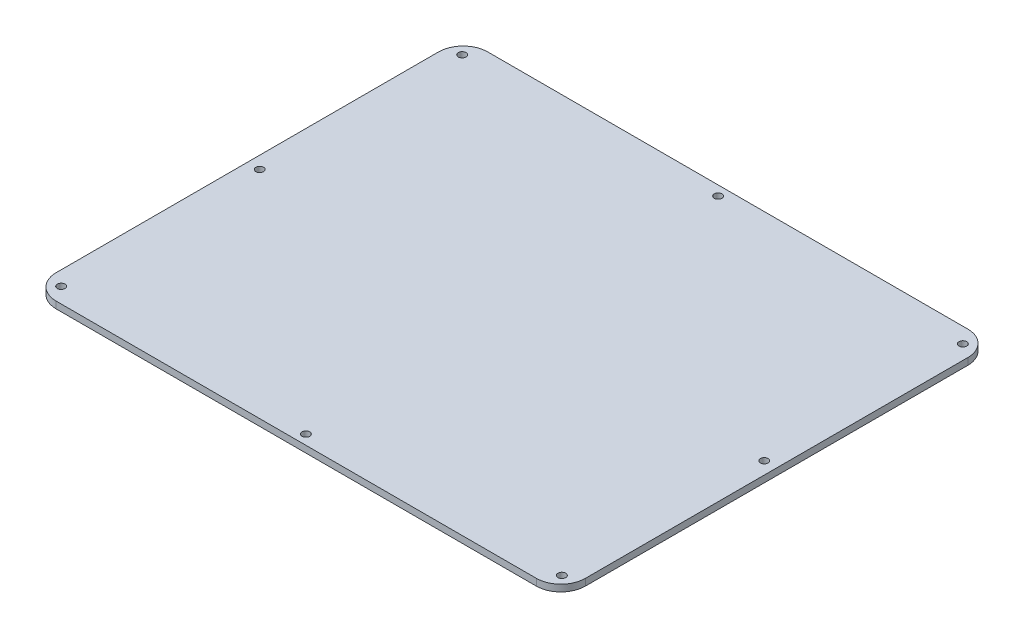
ISO-10303-21;
HEADER;
FILE_DESCRIPTION(('STEP AP214'),'2;1');
FILE_NAME('part.step','',(''),(''),'','','');
FILE_SCHEMA(('AUTOMOTIVE_DESIGN { 1 0 10303 214 1 1 1 1 }'));
ENDSEC;
DATA;
#1=APPLICATION_CONTEXT('core data for automotive mechanical design processes');
#2=APPLICATION_PROTOCOL_DEFINITION('international standard','automotive_design',2000,#1);
#3=PRODUCT_CONTEXT('',#1,'mechanical');
#4=PRODUCT('Part','Part','',(#3));
#5=PRODUCT_RELATED_PRODUCT_CATEGORY('part','',(#4));
#6=PRODUCT_DEFINITION_FORMATION('','',#4);
#7=PRODUCT_DEFINITION_CONTEXT('part definition',#1,'design');
#8=PRODUCT_DEFINITION('design','',#6,#7);
#9=PRODUCT_DEFINITION_SHAPE('','',#8);
#10=(LENGTH_UNIT() NAMED_UNIT(*) SI_UNIT(.MILLI.,.METRE.));
#11=(NAMED_UNIT(*) PLANE_ANGLE_UNIT() SI_UNIT($,.RADIAN.));
#12=(NAMED_UNIT(*) SI_UNIT($,.STERADIAN.) SOLID_ANGLE_UNIT());
#13=UNCERTAINTY_MEASURE_WITH_UNIT(LENGTH_MEASURE(1.E-05),#10,'distance_accuracy_value','');
#14=(GEOMETRIC_REPRESENTATION_CONTEXT(3) GLOBAL_UNCERTAINTY_ASSIGNED_CONTEXT((#13)) GLOBAL_UNIT_ASSIGNED_CONTEXT((#10,
#11,#12)) REPRESENTATION_CONTEXT('',''));
#15=CARTESIAN_POINT('',(0.,0.,0.));
#16=DIRECTION('',(0.,0.,1.));
#17=DIRECTION('',(1.,0.,0.));
#18=AXIS2_PLACEMENT_3D('',#15,#16,#17);
#19=CARTESIAN_POINT('',(0.,3.5,0.));
#20=DIRECTION('',(0.,1.,0.));
#21=DIRECTION('',(0.,0.,1.));
#22=AXIS2_PLACEMENT_3D('',#19,#20,#21);
#23=PLANE('',#22);
#24=CARTESIAN_POINT('',(-19.2686528028536,3.5,118.954205425769));
#25=DIRECTION('',(0.,-1.,0.));
#26=DIRECTION('',(0.,0.,-1.));
#27=AXIS2_PLACEMENT_3D('',#24,#25,#26);
#28=CIRCLE('',#27,2.);
#29=CARTESIAN_POINT('',(-19.2686528028536,3.5,116.954205425769));
#30=VERTEX_POINT('',#29);
#31=EDGE_CURVE('E204',#30,#30,#28,.T.);
#32=ORIENTED_EDGE('',*,*,#31,.T.);
#33=EDGE_LOOP('',(#32));
#34=FACE_BOUND('',#33,.T.);
#35=CARTESIAN_POINT('',(-149.618652802854,3.5,12.4542054257695));
#36=DIRECTION('',(0.,-1.,0.));
#37=DIRECTION('',(0.,0.,-1.));
#38=AXIS2_PLACEMENT_3D('',#35,#36,#37);
#39=CIRCLE('',#38,2.00000000000005);
#40=CARTESIAN_POINT('',(-149.618652802854,3.5,10.4542054257694));
#41=VERTEX_POINT('',#40);
#42=EDGE_CURVE('E180',#41,#41,#39,.T.);
#43=ORIENTED_EDGE('',*,*,#42,.T.);
#44=EDGE_LOOP('',(#43));
#45=FACE_BOUND('',#44,.T.);
#46=CARTESIAN_POINT('',(-148.618652802854,3.5,116.054205425769));
#47=DIRECTION('',(0.,1.,0.));
#48=DIRECTION('',(0.,0.,1.));
#49=AXIS2_PLACEMENT_3D('',#46,#47,#48);
#50=CIRCLE('',#49,2.);
#51=CARTESIAN_POINT('',(-148.618652802854,3.5,118.054205425769));
#52=VERTEX_POINT('',#51);
#53=EDGE_CURVE('E177',#52,#52,#50,.T.);
#54=ORIENTED_EDGE('',*,*,#53,.F.);
#55=EDGE_LOOP('',(#54));
#56=FACE_BOUND('',#55,.T.);
#57=DIRECTION('',(0.,0.,1.));
#58=VECTOR('',#57,1.);
#59=CARTESIAN_POINT('',(-156.018652802854,3.5,-99.0457945742306));
#60=LINE('',#59,#58);
#61=CARTESIAN_POINT('',(-156.018652802854,3.5,-86.3457945742306));
#62=VERTEX_POINT('',#61);
#63=CARTESIAN_POINT('',(-156.018652802854,3.5,111.254205425769));
#64=VERTEX_POINT('',#63);
#65=EDGE_CURVE('E137',#62,#64,#60,.T.);
#66=ORIENTED_EDGE('',*,*,#65,.T.);
#67=CARTESIAN_POINT('',(-143.318652802854,3.5,111.254205425769));
#68=DIRECTION('',(0.,1.,0.));
#69=DIRECTION('',(0.,0.,1.));
#70=AXIS2_PLACEMENT_3D('',#67,#68,#69);
#71=CIRCLE('',#70,12.7);
#72=CARTESIAN_POINT('',(-143.318652802854,3.5,123.954205425769));
#73=VERTEX_POINT('',#72);
#74=EDGE_CURVE('E152',#64,#73,#71,.T.);
#75=ORIENTED_EDGE('',*,*,#74,.T.);
#76=DIRECTION('',(1.,0.,0.));
#77=VECTOR('',#76,1.);
#78=CARTESIAN_POINT('',(-156.018652802854,3.5,123.954205425769));
#79=LINE('',#78,#77);
#80=CARTESIAN_POINT('',(104.781347197146,3.5,123.954205425769));
#81=VERTEX_POINT('',#80);
#82=EDGE_CURVE('E119',#73,#81,#79,.T.);
#83=ORIENTED_EDGE('',*,*,#82,.T.);
#84=CARTESIAN_POINT('',(104.781347197146,3.5,111.254205425769));
#85=DIRECTION('',(0.,1.,0.));
#86=DIRECTION('',(0.,0.,1.));
#87=AXIS2_PLACEMENT_3D('',#84,#85,#86);
#88=CIRCLE('',#87,12.7);
#89=CARTESIAN_POINT('',(117.481347197146,3.5,111.254205425769));
#90=VERTEX_POINT('',#89);
#91=EDGE_CURVE('E147',#81,#90,#88,.T.);
#92=ORIENTED_EDGE('',*,*,#91,.T.);
#93=DIRECTION('',(0.,0.,-1.));
#94=VECTOR('',#93,1.);
#95=CARTESIAN_POINT('',(117.481347197146,3.5,-99.0457945742306));
#96=LINE('',#95,#94);
#97=CARTESIAN_POINT('',(117.481347197146,3.5,-86.3457945742306));
#98=VERTEX_POINT('',#97);
#99=EDGE_CURVE('E163',#90,#98,#96,.T.);
#100=ORIENTED_EDGE('',*,*,#99,.T.);
#101=CARTESIAN_POINT('',(104.781347197146,3.5,-86.3457945742306));
#102=DIRECTION('',(0.,1.,0.));
#103=DIRECTION('',(0.,0.,1.));
#104=AXIS2_PLACEMENT_3D('',#101,#102,#103);
#105=CIRCLE('',#104,12.7);
#106=CARTESIAN_POINT('',(104.781347197146,3.5,-99.0457945742306));
#107=VERTEX_POINT('',#106);
#108=EDGE_CURVE('E55',#98,#107,#105,.T.);
#109=ORIENTED_EDGE('',*,*,#108,.T.);
#110=DIRECTION('',(-1.,0.,0.));
#111=VECTOR('',#110,1.);
#112=CARTESIAN_POINT('',(-156.018652802854,3.5,-99.0457945742306));
#113=LINE('',#112,#111);
#114=CARTESIAN_POINT('',(-143.318652802854,3.5,-99.0457945742306));
#115=VERTEX_POINT('',#114);
#116=EDGE_CURVE('E138',#107,#115,#113,.T.);
#117=ORIENTED_EDGE('',*,*,#116,.T.);
#118=CARTESIAN_POINT('',(-143.318652802854,3.5,-86.3457945742306));
#119=DIRECTION('',(0.,1.,0.));
#120=DIRECTION('',(0.,0.,1.));
#121=AXIS2_PLACEMENT_3D('',#118,#119,#120);
#122=CIRCLE('',#121,12.7);
#123=EDGE_CURVE('E150',#115,#62,#122,.T.);
#124=ORIENTED_EDGE('',*,*,#123,.T.);
#125=EDGE_LOOP('',(#66,#75,#83,#92,#100,#109,#117,#124));
#126=FACE_BOUND('',#125,.T.);
#127=CARTESIAN_POINT('',(-148.618652802854,3.5,-91.1457945742306));
#128=DIRECTION('',(0.,1.,0.));
#129=DIRECTION('',(0.,0.,1.));
#130=AXIS2_PLACEMENT_3D('',#127,#128,#129);
#131=CIRCLE('',#130,2.);
#132=CARTESIAN_POINT('',(-148.618652802854,3.5,-89.1457945742306));
#133=VERTEX_POINT('',#132);
#134=EDGE_CURVE('E193',#133,#133,#131,.T.);
#135=ORIENTED_EDGE('',*,*,#134,.F.);
#136=EDGE_LOOP('',(#135));
#137=FACE_BOUND('',#136,.T.);
#138=CARTESIAN_POINT('',(-19.2686528028536,3.5,-94.0457945742306));
#139=DIRECTION('',(0.,1.,0.));
#140=DIRECTION('',(0.,0.,1.));
#141=AXIS2_PLACEMENT_3D('',#138,#139,#140);
#142=CIRCLE('',#141,2.);
#143=CARTESIAN_POINT('',(-19.2686528028536,3.5,-92.0457945742306));
#144=VERTEX_POINT('',#143);
#145=EDGE_CURVE('E186',#144,#144,#142,.T.);
#146=ORIENTED_EDGE('',*,*,#145,.F.);
#147=EDGE_LOOP('',(#146));
#148=FACE_BOUND('',#147,.T.);
#149=CARTESIAN_POINT('',(111.081347197146,3.5,12.4542054257694));
#150=DIRECTION('',(0.,1.,0.));
#151=DIRECTION('',(0.,0.,1.));
#152=AXIS2_PLACEMENT_3D('',#149,#150,#151);
#153=CIRCLE('',#152,2.00000000000003);
#154=CARTESIAN_POINT('',(111.081347197146,3.5,14.4542054257694));
#155=VERTEX_POINT('',#154);
#156=EDGE_CURVE('E187',#155,#155,#153,.T.);
#157=ORIENTED_EDGE('',*,*,#156,.F.);
#158=EDGE_LOOP('',(#157));
#159=FACE_BOUND('',#158,.T.);
#160=CARTESIAN_POINT('',(110.081347197146,3.5,-91.1457945742306));
#161=DIRECTION('',(0.,1.,0.));
#162=DIRECTION('',(0.,0.,1.));
#163=AXIS2_PLACEMENT_3D('',#160,#161,#162);
#164=CIRCLE('',#163,2.);
#165=CARTESIAN_POINT('',(110.081347197146,3.5,-89.1457945742306));
#166=VERTEX_POINT('',#165);
#167=EDGE_CURVE('E216',#166,#166,#164,.T.);
#168=ORIENTED_EDGE('',*,*,#167,.F.);
#169=EDGE_LOOP('',(#168));
#170=FACE_BOUND('',#169,.T.);
#171=CARTESIAN_POINT('',(110.081347197146,3.5,116.054205425769));
#172=DIRECTION('',(0.,1.,0.));
#173=DIRECTION('',(0.,0.,1.));
#174=AXIS2_PLACEMENT_3D('',#171,#172,#173);
#175=CIRCLE('',#174,2.00000000000003);
#176=CARTESIAN_POINT('',(110.081347197146,3.5,118.054205425769));
#177=VERTEX_POINT('',#176);
#178=EDGE_CURVE('E210',#177,#177,#175,.T.);
#179=ORIENTED_EDGE('',*,*,#178,.F.);
#180=EDGE_LOOP('',(#179));
#181=FACE_BOUND('',#180,.T.);
#182=ADVANCED_FACE('F33',(#34,#45,#56,#126,#137,#148,#159,#170,#181),#23,.T.);
#183=CARTESIAN_POINT('',(0.,0.,0.));
#184=DIRECTION('',(0.,1.,0.));
#185=DIRECTION('',(0.,0.,1.));
#186=AXIS2_PLACEMENT_3D('',#183,#184,#185);
#187=PLANE('',#186);
#188=CARTESIAN_POINT('',(-19.2686528028536,0.,118.954205425769));
#189=DIRECTION('',(0.,-1.,0.));
#190=DIRECTION('',(0.,0.,-1.));
#191=AXIS2_PLACEMENT_3D('',#188,#189,#190);
#192=CIRCLE('',#191,2.);
#193=CARTESIAN_POINT('',(-19.2686528028536,0.,116.954205425769));
#194=VERTEX_POINT('',#193);
#195=EDGE_CURVE('E201',#194,#194,#192,.T.);
#196=ORIENTED_EDGE('',*,*,#195,.F.);
#197=EDGE_LOOP('',(#196));
#198=FACE_BOUND('',#197,.T.);
#199=CARTESIAN_POINT('',(110.081347197146,0.,-91.1457945742306));
#200=DIRECTION('',(0.,1.,0.));
#201=DIRECTION('',(0.,0.,1.));
#202=AXIS2_PLACEMENT_3D('',#199,#200,#201);
#203=CIRCLE('',#202,2.);
#204=CARTESIAN_POINT('',(110.081347197146,0.,-89.1457945742306));
#205=VERTEX_POINT('',#204);
#206=EDGE_CURVE('E213',#205,#205,#203,.T.);
#207=ORIENTED_EDGE('',*,*,#206,.T.);
#208=EDGE_LOOP('',(#207));
#209=FACE_BOUND('',#208,.T.);
#210=CARTESIAN_POINT('',(-19.2686528028536,0.,-94.0457945742306));
#211=DIRECTION('',(0.,1.,0.));
#212=DIRECTION('',(0.,0.,1.));
#213=AXIS2_PLACEMENT_3D('',#210,#211,#212);
#214=CIRCLE('',#213,2.);
#215=CARTESIAN_POINT('',(-19.2686528028536,0.,-92.0457945742306));
#216=VERTEX_POINT('',#215);
#217=EDGE_CURVE('E183',#216,#216,#214,.T.);
#218=ORIENTED_EDGE('',*,*,#217,.T.);
#219=EDGE_LOOP('',(#218));
#220=FACE_BOUND('',#219,.T.);
#221=DIRECTION('',(1.,0.,0.));
#222=VECTOR('',#221,1.);
#223=CARTESIAN_POINT('',(-156.018652802854,0.,123.954205425769));
#224=LINE('',#223,#222);
#225=CARTESIAN_POINT('',(-143.318652802854,0.,123.954205425769));
#226=VERTEX_POINT('',#225);
#227=CARTESIAN_POINT('',(104.781347197146,0.,123.954205425769));
#228=VERTEX_POINT('',#227);
#229=EDGE_CURVE('E116',#226,#228,#224,.T.);
#230=ORIENTED_EDGE('',*,*,#229,.F.);
#231=CARTESIAN_POINT('',(-143.318652802854,0.,111.254205425769));
#232=DIRECTION('',(0.,1.,0.));
#233=DIRECTION('',(0.,0.,1.));
#234=AXIS2_PLACEMENT_3D('',#231,#232,#233);
#235=CIRCLE('',#234,12.7);
#236=CARTESIAN_POINT('',(-156.018652802854,0.,111.254205425769));
#237=VERTEX_POINT('',#236);
#238=EDGE_CURVE('E99',#226,#237,#235,.F.);
#239=ORIENTED_EDGE('',*,*,#238,.T.);
#240=DIRECTION('',(0.,0.,1.));
#241=VECTOR('',#240,1.);
#242=CARTESIAN_POINT('',(-156.018652802854,0.,-99.0457945742306));
#243=LINE('',#242,#241);
#244=CARTESIAN_POINT('',(-156.018652802854,0.,-86.3457945742306));
#245=VERTEX_POINT('',#244);
#246=EDGE_CURVE('E127',#245,#237,#243,.T.);
#247=ORIENTED_EDGE('',*,*,#246,.F.);
#248=CARTESIAN_POINT('',(-143.318652802854,0.,-86.3457945742306));
#249=DIRECTION('',(0.,1.,0.));
#250=DIRECTION('',(0.,0.,1.));
#251=AXIS2_PLACEMENT_3D('',#248,#249,#250);
#252=CIRCLE('',#251,12.7);
#253=CARTESIAN_POINT('',(-143.318652802854,0.,-99.0457945742306));
#254=VERTEX_POINT('',#253);
#255=EDGE_CURVE('E110',#245,#254,#252,.F.);
#256=ORIENTED_EDGE('',*,*,#255,.T.);
#257=DIRECTION('',(-1.,0.,0.));
#258=VECTOR('',#257,1.);
#259=CARTESIAN_POINT('',(-156.018652802854,0.,-99.0457945742306));
#260=LINE('',#259,#258);
#261=CARTESIAN_POINT('',(104.781347197146,0.,-99.0457945742306));
#262=VERTEX_POINT('',#261);
#263=EDGE_CURVE('E130',#262,#254,#260,.T.);
#264=ORIENTED_EDGE('',*,*,#263,.F.);
#265=CARTESIAN_POINT('',(104.781347197146,0.,-86.3457945742306));
#266=DIRECTION('',(0.,1.,0.));
#267=DIRECTION('',(0.,0.,1.));
#268=AXIS2_PLACEMENT_3D('',#265,#266,#267);
#269=CIRCLE('',#268,12.7);
#270=CARTESIAN_POINT('',(117.481347197146,0.,-86.3457945742306));
#271=VERTEX_POINT('',#270);
#272=EDGE_CURVE('E141',#262,#271,#269,.F.);
#273=ORIENTED_EDGE('',*,*,#272,.T.);
#274=DIRECTION('',(0.,0.,-1.));
#275=VECTOR('',#274,1.);
#276=CARTESIAN_POINT('',(117.481347197146,0.,-99.0457945742306));
#277=LINE('',#276,#275);
#278=CARTESIAN_POINT('',(117.481347197146,0.,111.254205425769));
#279=VERTEX_POINT('',#278);
#280=EDGE_CURVE('E126',#279,#271,#277,.T.);
#281=ORIENTED_EDGE('',*,*,#280,.F.);
#282=CARTESIAN_POINT('',(104.781347197146,0.,111.254205425769));
#283=DIRECTION('',(0.,1.,0.));
#284=DIRECTION('',(0.,0.,1.));
#285=AXIS2_PLACEMENT_3D('',#282,#283,#284);
#286=CIRCLE('',#285,12.7);
#287=EDGE_CURVE('E120',#279,#228,#286,.F.);
#288=ORIENTED_EDGE('',*,*,#287,.T.);
#289=EDGE_LOOP('',(#230,#239,#247,#256,#264,#273,#281,#288));
#290=FACE_BOUND('',#289,.T.);
#291=CARTESIAN_POINT('',(-148.618652802854,0.,116.054205425769));
#292=DIRECTION('',(0.,1.,0.));
#293=DIRECTION('',(0.,0.,1.));
#294=AXIS2_PLACEMENT_3D('',#291,#292,#293);
#295=CIRCLE('',#294,2.);
#296=CARTESIAN_POINT('',(-148.618652802854,0.,118.054205425769));
#297=VERTEX_POINT('',#296);
#298=EDGE_CURVE('E132',#297,#297,#295,.T.);
#299=ORIENTED_EDGE('',*,*,#298,.T.);
#300=EDGE_LOOP('',(#299));
#301=FACE_BOUND('',#300,.T.);
#302=CARTESIAN_POINT('',(-149.618652802854,0.,12.4542054257695));
#303=DIRECTION('',(0.,-1.,0.));
#304=DIRECTION('',(0.,0.,-1.));
#305=AXIS2_PLACEMENT_3D('',#302,#303,#304);
#306=CIRCLE('',#305,2.00000000000005);
#307=CARTESIAN_POINT('',(-149.618652802854,0.,10.4542054257694));
#308=VERTEX_POINT('',#307);
#309=EDGE_CURVE('E196',#308,#308,#306,.T.);
#310=ORIENTED_EDGE('',*,*,#309,.F.);
#311=EDGE_LOOP('',(#310));
#312=FACE_BOUND('',#311,.T.);
#313=CARTESIAN_POINT('',(-148.618652802854,0.,-91.1457945742306));
#314=DIRECTION('',(0.,1.,0.));
#315=DIRECTION('',(0.,0.,1.));
#316=AXIS2_PLACEMENT_3D('',#313,#314,#315);
#317=CIRCLE('',#316,2.);
#318=CARTESIAN_POINT('',(-148.618652802854,0.,-89.1457945742306));
#319=VERTEX_POINT('',#318);
#320=EDGE_CURVE('E190',#319,#319,#317,.T.);
#321=ORIENTED_EDGE('',*,*,#320,.T.);
#322=EDGE_LOOP('',(#321));
#323=FACE_BOUND('',#322,.T.);
#324=CARTESIAN_POINT('',(111.081347197146,0.,12.4542054257694));
#325=DIRECTION('',(0.,1.,0.));
#326=DIRECTION('',(0.,0.,1.));
#327=AXIS2_PLACEMENT_3D('',#324,#325,#326);
#328=CIRCLE('',#327,2.00000000000003);
#329=CARTESIAN_POINT('',(111.081347197146,0.,14.4542054257694));
#330=VERTEX_POINT('',#329);
#331=EDGE_CURVE('E219',#330,#330,#328,.T.);
#332=ORIENTED_EDGE('',*,*,#331,.T.);
#333=EDGE_LOOP('',(#332));
#334=FACE_BOUND('',#333,.T.);
#335=CARTESIAN_POINT('',(110.081347197146,0.,116.054205425769));
#336=DIRECTION('',(0.,1.,0.));
#337=DIRECTION('',(0.,0.,1.));
#338=AXIS2_PLACEMENT_3D('',#335,#336,#337);
#339=CIRCLE('',#338,2.00000000000003);
#340=CARTESIAN_POINT('',(110.081347197146,0.,118.054205425769));
#341=VERTEX_POINT('',#340);
#342=EDGE_CURVE('E207',#341,#341,#339,.T.);
#343=ORIENTED_EDGE('',*,*,#342,.T.);
#344=EDGE_LOOP('',(#343));
#345=FACE_BOUND('',#344,.T.);
#346=ADVANCED_FACE('F123',(#198,#209,#220,#290,#301,#312,#323,#334,#345),#187,.F.);
#347=CARTESIAN_POINT('',(-156.018652802854,3.5,-99.0457945742306));
#348=DIRECTION('',(1.,0.,0.));
#349=DIRECTION('',(0.,0.,-1.));
#350=AXIS2_PLACEMENT_3D('',#347,#348,#349);
#351=PLANE('',#350);
#352=ORIENTED_EDGE('',*,*,#246,.T.);
#353=DIRECTION('',(0.,-1.,0.));
#354=VECTOR('',#353,1.);
#355=CARTESIAN_POINT('',(-156.018652802854,3.5,111.254205425769));
#356=LINE('',#355,#354);
#357=EDGE_CURVE('E104',#237,#64,#356,.F.);
#358=ORIENTED_EDGE('',*,*,#357,.T.);
#359=ORIENTED_EDGE('',*,*,#65,.F.);
#360=DIRECTION('',(0.,-1.,0.));
#361=VECTOR('',#360,1.);
#362=CARTESIAN_POINT('',(-156.018652802854,3.5,-86.3457945742306));
#363=LINE('',#362,#361);
#364=EDGE_CURVE('E109',#62,#245,#363,.T.);
#365=ORIENTED_EDGE('',*,*,#364,.T.);
#366=EDGE_LOOP('',(#352,#358,#359,#365));
#367=FACE_BOUND('',#366,.T.);
#368=ADVANCED_FACE('F270',(#367),#351,.F.);
#369=CARTESIAN_POINT('',(-156.018652802854,3.5,123.954205425769));
#370=DIRECTION('',(0.,0.,-1.));
#371=DIRECTION('',(-1.,0.,0.));
#372=AXIS2_PLACEMENT_3D('',#369,#370,#371);
#373=PLANE('',#372);
#374=ORIENTED_EDGE('',*,*,#82,.F.);
#375=DIRECTION('',(0.,-1.,0.));
#376=VECTOR('',#375,1.);
#377=CARTESIAN_POINT('',(-143.318652802854,3.5,123.954205425769));
#378=LINE('',#377,#376);
#379=EDGE_CURVE('E103',#73,#226,#378,.T.);
#380=ORIENTED_EDGE('',*,*,#379,.T.);
#381=ORIENTED_EDGE('',*,*,#229,.T.);
#382=DIRECTION('',(0.,-1.,0.));
#383=VECTOR('',#382,1.);
#384=CARTESIAN_POINT('',(104.781347197146,3.5,123.954205425769));
#385=LINE('',#384,#383);
#386=EDGE_CURVE('E121',#228,#81,#385,.F.);
#387=ORIENTED_EDGE('',*,*,#386,.T.);
#388=EDGE_LOOP('',(#374,#380,#381,#387));
#389=FACE_BOUND('',#388,.T.);
#390=ADVANCED_FACE('F115',(#389),#373,.F.);
#391=CARTESIAN_POINT('',(117.481347197146,3.5,-99.0457945742306));
#392=DIRECTION('',(-1.,0.,0.));
#393=DIRECTION('',(0.,0.,1.));
#394=AXIS2_PLACEMENT_3D('',#391,#392,#393);
#395=PLANE('',#394);
#396=ORIENTED_EDGE('',*,*,#280,.T.);
#397=DIRECTION('',(0.,-1.,0.));
#398=VECTOR('',#397,1.);
#399=CARTESIAN_POINT('',(117.481347197146,3.5,-86.3457945742306));
#400=LINE('',#399,#398);
#401=EDGE_CURVE('E11',#271,#98,#400,.F.);
#402=ORIENTED_EDGE('',*,*,#401,.T.);
#403=ORIENTED_EDGE('',*,*,#99,.F.);
#404=DIRECTION('',(0.,-1.,0.));
#405=VECTOR('',#404,1.);
#406=CARTESIAN_POINT('',(117.481347197146,3.5,111.254205425769));
#407=LINE('',#406,#405);
#408=EDGE_CURVE('E41',#90,#279,#407,.T.);
#409=ORIENTED_EDGE('',*,*,#408,.T.);
#410=EDGE_LOOP('',(#396,#402,#403,#409));
#411=FACE_BOUND('',#410,.T.);
#412=ADVANCED_FACE('F161',(#411),#395,.F.);
#413=CARTESIAN_POINT('',(-156.018652802854,3.5,-99.0457945742306));
#414=DIRECTION('',(0.,0.,1.));
#415=DIRECTION('',(1.,0.,0.));
#416=AXIS2_PLACEMENT_3D('',#413,#414,#415);
#417=PLANE('',#416);
#418=ORIENTED_EDGE('',*,*,#263,.T.);
#419=DIRECTION('',(0.,-1.,0.));
#420=VECTOR('',#419,1.);
#421=CARTESIAN_POINT('',(-143.318652802854,3.5,-99.0457945742306));
#422=LINE('',#421,#420);
#423=EDGE_CURVE('E48',#254,#115,#422,.F.);
#424=ORIENTED_EDGE('',*,*,#423,.T.);
#425=ORIENTED_EDGE('',*,*,#116,.F.);
#426=DIRECTION('',(0.,-1.,0.));
#427=VECTOR('',#426,1.);
#428=CARTESIAN_POINT('',(104.781347197146,3.5,-99.0457945742306));
#429=LINE('',#428,#427);
#430=EDGE_CURVE('E154',#107,#262,#429,.T.);
#431=ORIENTED_EDGE('',*,*,#430,.T.);
#432=EDGE_LOOP('',(#418,#424,#425,#431));
#433=FACE_BOUND('',#432,.T.);
#434=ADVANCED_FACE('F170',(#433),#417,.F.);
#435=CARTESIAN_POINT('',(-143.318652802854,3.5,111.254205425769));
#436=DIRECTION('',(0.,-1.,0.));
#437=DIRECTION('',(0.,0.,-1.));
#438=AXIS2_PLACEMENT_3D('',#435,#436,#437);
#439=CYLINDRICAL_SURFACE('',#438,12.7);
#440=ORIENTED_EDGE('',*,*,#74,.F.);
#441=ORIENTED_EDGE('',*,*,#357,.F.);
#442=ORIENTED_EDGE('',*,*,#238,.F.);
#443=ORIENTED_EDGE('',*,*,#379,.F.);
#444=EDGE_LOOP('',(#440,#441,#442,#443));
#445=FACE_BOUND('',#444,.T.);
#446=ADVANCED_FACE('F102',(#445),#439,.T.);
#447=CARTESIAN_POINT('',(-143.318652802854,3.5,-86.3457945742306));
#448=DIRECTION('',(0.,-1.,0.));
#449=DIRECTION('',(0.,0.,-1.));
#450=AXIS2_PLACEMENT_3D('',#447,#448,#449);
#451=CYLINDRICAL_SURFACE('',#450,12.7);
#452=ORIENTED_EDGE('',*,*,#123,.F.);
#453=ORIENTED_EDGE('',*,*,#423,.F.);
#454=ORIENTED_EDGE('',*,*,#255,.F.);
#455=ORIENTED_EDGE('',*,*,#364,.F.);
#456=EDGE_LOOP('',(#452,#453,#454,#455));
#457=FACE_BOUND('',#456,.T.);
#458=ADVANCED_FACE('F283',(#457),#451,.T.);
#459=CARTESIAN_POINT('',(104.781347197146,3.5,-86.3457945742306));
#460=DIRECTION('',(0.,-1.,0.));
#461=DIRECTION('',(0.,0.,-1.));
#462=AXIS2_PLACEMENT_3D('',#459,#460,#461);
#463=CYLINDRICAL_SURFACE('',#462,12.7);
#464=ORIENTED_EDGE('',*,*,#108,.F.);
#465=ORIENTED_EDGE('',*,*,#401,.F.);
#466=ORIENTED_EDGE('',*,*,#272,.F.);
#467=ORIENTED_EDGE('',*,*,#430,.F.);
#468=EDGE_LOOP('',(#464,#465,#466,#467));
#469=FACE_BOUND('',#468,.T.);
#470=ADVANCED_FACE('F169',(#469),#463,.T.);
#471=CARTESIAN_POINT('',(104.781347197146,3.5,111.254205425769));
#472=DIRECTION('',(0.,-1.,0.));
#473=DIRECTION('',(0.,0.,-1.));
#474=AXIS2_PLACEMENT_3D('',#471,#472,#473);
#475=CYLINDRICAL_SURFACE('',#474,12.7);
#476=ORIENTED_EDGE('',*,*,#91,.F.);
#477=ORIENTED_EDGE('',*,*,#386,.F.);
#478=ORIENTED_EDGE('',*,*,#287,.F.);
#479=ORIENTED_EDGE('',*,*,#408,.F.);
#480=EDGE_LOOP('',(#476,#477,#478,#479));
#481=FACE_BOUND('',#480,.T.);
#482=ADVANCED_FACE('F35',(#481),#475,.T.);
#483=CARTESIAN_POINT('',(-148.618652802854,0.,116.054205425769));
#484=DIRECTION('',(0.,1.,0.));
#485=DIRECTION('',(0.,0.,1.));
#486=AXIS2_PLACEMENT_3D('',#483,#484,#485);
#487=CYLINDRICAL_SURFACE('',#486,2.);
#488=ORIENTED_EDGE('',*,*,#298,.F.);
#489=EDGE_LOOP('',(#488));
#490=FACE_BOUND('',#489,.T.);
#491=ORIENTED_EDGE('',*,*,#53,.T.);
#492=EDGE_LOOP('',(#491));
#493=FACE_BOUND('',#492,.T.);
#494=ADVANCED_FACE('F256',(#490,#493),#487,.F.);
#495=CARTESIAN_POINT('',(-149.618652802854,0.,12.4542054257695));
#496=DIRECTION('',(0.,1.,0.));
#497=DIRECTION('',(0.,0.,1.));
#498=AXIS2_PLACEMENT_3D('',#495,#496,#497);
#499=CYLINDRICAL_SURFACE('',#498,2.00000000000005);
#500=ORIENTED_EDGE('',*,*,#309,.T.);
#501=EDGE_LOOP('',(#500));
#502=FACE_BOUND('',#501,.T.);
#503=ORIENTED_EDGE('',*,*,#42,.F.);
#504=EDGE_LOOP('',(#503));
#505=FACE_BOUND('',#504,.T.);
#506=ADVANCED_FACE('F252',(#502,#505),#499,.F.);
#507=CARTESIAN_POINT('',(-148.618652802854,0.,-91.1457945742306));
#508=DIRECTION('',(0.,1.,0.));
#509=DIRECTION('',(0.,0.,1.));
#510=AXIS2_PLACEMENT_3D('',#507,#508,#509);
#511=CYLINDRICAL_SURFACE('',#510,2.);
#512=ORIENTED_EDGE('',*,*,#320,.F.);
#513=EDGE_LOOP('',(#512));
#514=FACE_BOUND('',#513,.T.);
#515=ORIENTED_EDGE('',*,*,#134,.T.);
#516=EDGE_LOOP('',(#515));
#517=FACE_BOUND('',#516,.T.);
#518=ADVANCED_FACE('F255',(#514,#517),#511,.F.);
#519=CARTESIAN_POINT('',(-19.2686528028536,0.,-94.0457945742306));
#520=DIRECTION('',(0.,1.,0.));
#521=DIRECTION('',(0.,0.,1.));
#522=AXIS2_PLACEMENT_3D('',#519,#520,#521);
#523=CYLINDRICAL_SURFACE('',#522,2.);
#524=ORIENTED_EDGE('',*,*,#217,.F.);
#525=EDGE_LOOP('',(#524));
#526=FACE_BOUND('',#525,.T.);
#527=ORIENTED_EDGE('',*,*,#145,.T.);
#528=EDGE_LOOP('',(#527));
#529=FACE_BOUND('',#528,.T.);
#530=ADVANCED_FACE('F260',(#526,#529),#523,.F.);
#531=CARTESIAN_POINT('',(111.081347197146,0.,12.4542054257694));
#532=DIRECTION('',(0.,1.,0.));
#533=DIRECTION('',(0.,0.,1.));
#534=AXIS2_PLACEMENT_3D('',#531,#532,#533);
#535=CYLINDRICAL_SURFACE('',#534,2.00000000000003);
#536=ORIENTED_EDGE('',*,*,#331,.F.);
#537=EDGE_LOOP('',(#536));
#538=FACE_BOUND('',#537,.T.);
#539=ORIENTED_EDGE('',*,*,#156,.T.);
#540=EDGE_LOOP('',(#539));
#541=FACE_BOUND('',#540,.T.);
#542=ADVANCED_FACE('F225',(#538,#541),#535,.F.);
#543=CARTESIAN_POINT('',(110.081347197146,0.,-91.1457945742306));
#544=DIRECTION('',(0.,1.,0.));
#545=DIRECTION('',(0.,0.,1.));
#546=AXIS2_PLACEMENT_3D('',#543,#544,#545);
#547=CYLINDRICAL_SURFACE('',#546,2.);
#548=ORIENTED_EDGE('',*,*,#206,.F.);
#549=EDGE_LOOP('',(#548));
#550=FACE_BOUND('',#549,.T.);
#551=ORIENTED_EDGE('',*,*,#167,.T.);
#552=EDGE_LOOP('',(#551));
#553=FACE_BOUND('',#552,.T.);
#554=ADVANCED_FACE('F238',(#550,#553),#547,.F.);
#555=CARTESIAN_POINT('',(110.081347197146,0.,116.054205425769));
#556=DIRECTION('',(0.,1.,0.));
#557=DIRECTION('',(0.,0.,1.));
#558=AXIS2_PLACEMENT_3D('',#555,#556,#557);
#559=CYLINDRICAL_SURFACE('',#558,2.00000000000003);
#560=ORIENTED_EDGE('',*,*,#342,.F.);
#561=EDGE_LOOP('',(#560));
#562=FACE_BOUND('',#561,.T.);
#563=ORIENTED_EDGE('',*,*,#178,.T.);
#564=EDGE_LOOP('',(#563));
#565=FACE_BOUND('',#564,.T.);
#566=ADVANCED_FACE('F235',(#562,#565),#559,.F.);
#567=CARTESIAN_POINT('',(-19.2686528028536,0.,118.954205425769));
#568=DIRECTION('',(0.,1.,0.));
#569=DIRECTION('',(0.,0.,1.));
#570=AXIS2_PLACEMENT_3D('',#567,#568,#569);
#571=CYLINDRICAL_SURFACE('',#570,2.);
#572=ORIENTED_EDGE('',*,*,#195,.T.);
#573=EDGE_LOOP('',(#572));
#574=FACE_BOUND('',#573,.T.);
#575=ORIENTED_EDGE('',*,*,#31,.F.);
#576=EDGE_LOOP('',(#575));
#577=FACE_BOUND('',#576,.T.);
#578=ADVANCED_FACE('F237',(#574,#577),#571,.F.);
#579=CLOSED_SHELL('',(#182,#346,#368,#390,#412,#434,#446,#458,#470,#482,#494,#506,#518,#530,
#542,#554,#566,#578));
#580=MANIFOLD_SOLID_BREP('B2',#579);
#581=ADVANCED_BREP_SHAPE_REPRESENTATION('',(#18,#580),#14);
#582=SHAPE_DEFINITION_REPRESENTATION(#9,#581);
ENDSEC;
END-ISO-10303-21;
